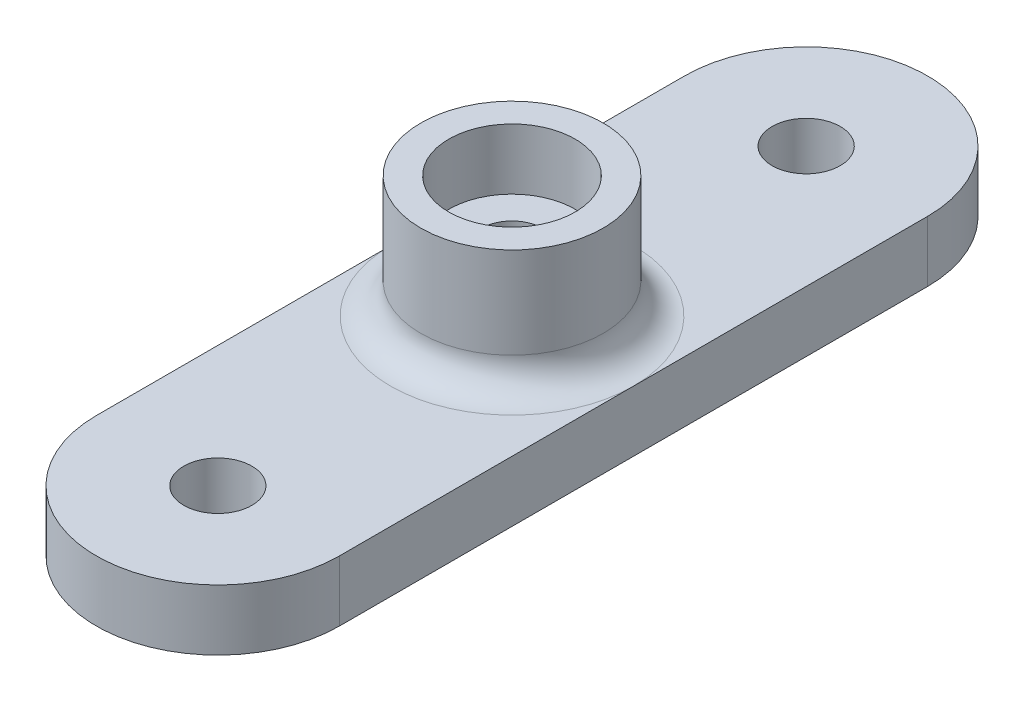
ISO-10303-21;
HEADER;
FILE_DESCRIPTION(('STEP AP214'),'2;1');
FILE_NAME('part.step','',(''),(''),'','','');
FILE_SCHEMA(('AUTOMOTIVE_DESIGN { 1 0 10303 214 1 1 1 1 }'));
ENDSEC;
DATA;
#1=APPLICATION_CONTEXT('core data for automotive mechanical design processes');
#2=APPLICATION_PROTOCOL_DEFINITION('international standard','automotive_design',2000,#1);
#3=PRODUCT_CONTEXT('',#1,'mechanical');
#4=PRODUCT('Part','Part','',(#3));
#5=PRODUCT_RELATED_PRODUCT_CATEGORY('part','',(#4));
#6=PRODUCT_DEFINITION_FORMATION('','',#4);
#7=PRODUCT_DEFINITION_CONTEXT('part definition',#1,'design');
#8=PRODUCT_DEFINITION('design','',#6,#7);
#9=PRODUCT_DEFINITION_SHAPE('','',#8);
#10=(LENGTH_UNIT() NAMED_UNIT(*) SI_UNIT(.MILLI.,.METRE.));
#11=(NAMED_UNIT(*) PLANE_ANGLE_UNIT() SI_UNIT($,.RADIAN.));
#12=(NAMED_UNIT(*) SI_UNIT($,.STERADIAN.) SOLID_ANGLE_UNIT());
#13=UNCERTAINTY_MEASURE_WITH_UNIT(LENGTH_MEASURE(1.E-05),#10,'distance_accuracy_value','');
#14=(GEOMETRIC_REPRESENTATION_CONTEXT(3) GLOBAL_UNCERTAINTY_ASSIGNED_CONTEXT((#13)) GLOBAL_UNIT_ASSIGNED_CONTEXT((#10,
#11,#12)) REPRESENTATION_CONTEXT('',''));
#15=CARTESIAN_POINT('',(0.,0.,0.));
#16=DIRECTION('',(0.,0.,1.));
#17=DIRECTION('',(1.,0.,0.));
#18=AXIS2_PLACEMENT_3D('',#15,#16,#17);
#19=CARTESIAN_POINT('',(0.,3.175,-15.367));
#20=DIRECTION('',(0.,1.,0.));
#21=DIRECTION('',(0.,0.,1.));
#22=AXIS2_PLACEMENT_3D('',#19,#20,#21);
#23=PLANE('',#22);
#24=CARTESIAN_POINT('',(0.,3.175,-15.367));
#25=DIRECTION('',(0.,1.,0.));
#26=DIRECTION('',(0.,0.,1.));
#27=AXIS2_PLACEMENT_3D('',#24,#25,#26);
#28=CIRCLE('',#27,1.778);
#29=CARTESIAN_POINT('',(0.,3.175,-13.589));
#30=VERTEX_POINT('',#29);
#31=EDGE_CURVE('E138',#30,#30,#28,.T.);
#32=ORIENTED_EDGE('',*,*,#31,.F.);
#33=EDGE_LOOP('',(#32));
#34=FACE_BOUND('',#33,.T.);
#35=DIRECTION('',(0.,0.,1.));
#36=VECTOR('',#35,1.);
#37=CARTESIAN_POINT('',(-6.35000000000001,3.175,-15.367));
#38=LINE('',#37,#36);
#39=CARTESIAN_POINT('',(-6.35000000000001,3.175,-15.367));
#40=VERTEX_POINT('',#39);
#41=CARTESIAN_POINT('',(-6.35,3.175,0.));
#42=VERTEX_POINT('',#41);
#43=EDGE_CURVE('E79',#40,#42,#38,.T.);
#44=ORIENTED_EDGE('',*,*,#43,.T.);
#45=CARTESIAN_POINT('',(0.,3.175,0.));
#46=DIRECTION('',(0.,1.,0.));
#47=DIRECTION('',(0.,0.,1.));
#48=AXIS2_PLACEMENT_3D('',#45,#46,#47);
#49=CIRCLE('',#48,6.35);
#50=CARTESIAN_POINT('',(6.35,3.175,0.));
#51=VERTEX_POINT('',#50);
#52=EDGE_CURVE('E12',#42,#51,#49,.F.);
#53=ORIENTED_EDGE('',*,*,#52,.T.);
#54=DIRECTION('',(0.,0.,-1.));
#55=VECTOR('',#54,1.);
#56=CARTESIAN_POINT('',(6.34999999999999,3.175,-15.367));
#57=LINE('',#56,#55);
#58=CARTESIAN_POINT('',(6.34999999999999,3.175,-15.367));
#59=VERTEX_POINT('',#58);
#60=EDGE_CURVE('E93',#51,#59,#57,.T.);
#61=ORIENTED_EDGE('',*,*,#60,.T.);
#62=CARTESIAN_POINT('',(0.,3.175,-15.367));
#63=DIRECTION('',(0.,1.,0.));
#64=DIRECTION('',(0.,0.,1.));
#65=AXIS2_PLACEMENT_3D('',#62,#63,#64);
#66=CIRCLE('',#65,6.35);
#67=EDGE_CURVE('E91',#59,#40,#66,.T.);
#68=ORIENTED_EDGE('',*,*,#67,.T.);
#69=EDGE_LOOP('',(#44,#53,#61,#68));
#70=FACE_BOUND('',#69,.T.);
#71=ADVANCED_FACE('F35',(#34,#70),#23,.T.);
#72=CARTESIAN_POINT('',(0.,3.175,0.));
#73=DIRECTION('',(0.,-1.,0.));
#74=DIRECTION('',(0.,0.,-1.));
#75=AXIS2_PLACEMENT_3D('',#72,#73,#74);
#76=CYLINDRICAL_SURFACE('',#75,1.5875);
#77=CARTESIAN_POINT('',(0.,0.,0.));
#78=DIRECTION('',(0.,1.,0.));
#79=DIRECTION('',(0.,0.,1.));
#80=AXIS2_PLACEMENT_3D('',#77,#78,#79);
#81=CIRCLE('',#80,1.5875);
#82=CARTESIAN_POINT('',(0.,0.,1.5875));
#83=VERTEX_POINT('',#82);
#84=EDGE_CURVE('E119',#83,#83,#81,.T.);
#85=ORIENTED_EDGE('',*,*,#84,.F.);
#86=EDGE_LOOP('',(#85));
#87=FACE_BOUND('',#86,.T.);
#88=CARTESIAN_POINT('',(0.,6.35,0.));
#89=DIRECTION('',(0.,1.,0.));
#90=DIRECTION('',(0.,0.,1.));
#91=AXIS2_PLACEMENT_3D('',#88,#89,#90);
#92=CIRCLE('',#91,1.5875);
#93=CARTESIAN_POINT('',(0.,6.35,1.5875));
#94=VERTEX_POINT('',#93);
#95=EDGE_CURVE('E112',#94,#94,#92,.T.);
#96=ORIENTED_EDGE('',*,*,#95,.T.);
#97=EDGE_LOOP('',(#96));
#98=FACE_BOUND('',#97,.T.);
#99=ADVANCED_FACE('F169',(#87,#98),#76,.F.);
#100=CARTESIAN_POINT('',(6.35,3.175,15.367));
#101=VERTEX_POINT('',#100);
#102=EDGE_CURVE('E144',#101,#51,#57,.T.);
#103=ORIENTED_EDGE('',*,*,#102,.T.);
#104=CARTESIAN_POINT('',(0.,3.175,0.));
#105=DIRECTION('',(0.,1.,0.));
#106=DIRECTION('',(0.,0.,1.));
#107=AXIS2_PLACEMENT_3D('',#104,#105,#106);
#108=CIRCLE('',#107,6.35);
#109=EDGE_CURVE('E43',#51,#42,#108,.F.);
#110=ORIENTED_EDGE('',*,*,#109,.T.);
#111=CARTESIAN_POINT('',(-6.34999999999999,3.175,15.367));
#112=VERTEX_POINT('',#111);
#113=EDGE_CURVE('E86',#42,#112,#38,.T.);
#114=ORIENTED_EDGE('',*,*,#113,.T.);
#115=CARTESIAN_POINT('',(0.,3.175,15.367));
#116=DIRECTION('',(0.,1.,0.));
#117=DIRECTION('',(0.,0.,1.));
#118=AXIS2_PLACEMENT_3D('',#115,#116,#117);
#119=CIRCLE('',#118,6.35);
#120=EDGE_CURVE('E88',#112,#101,#119,.T.);
#121=ORIENTED_EDGE('',*,*,#120,.T.);
#122=EDGE_LOOP('',(#103,#110,#114,#121));
#123=FACE_BOUND('',#122,.T.);
#124=CARTESIAN_POINT('',(0.,3.175,15.367));
#125=DIRECTION('',(0.,1.,0.));
#126=DIRECTION('',(0.,0.,1.));
#127=AXIS2_PLACEMENT_3D('',#124,#125,#126);
#128=CIRCLE('',#127,1.778);
#129=CARTESIAN_POINT('',(0.,3.175,17.145));
#130=VERTEX_POINT('',#129);
#131=EDGE_CURVE('E132',#130,#130,#128,.T.);
#132=ORIENTED_EDGE('',*,*,#131,.F.);
#133=EDGE_LOOP('',(#132));
#134=FACE_BOUND('',#133,.T.);
#135=ADVANCED_FACE('F166',(#123,#134),#23,.T.);
#136=CARTESIAN_POINT('',(0.,0.,-15.367));
#137=DIRECTION('',(0.,1.,0.));
#138=DIRECTION('',(0.,0.,1.));
#139=AXIS2_PLACEMENT_3D('',#136,#137,#138);
#140=PLANE('',#139);
#141=CARTESIAN_POINT('',(0.,0.,-15.367));
#142=DIRECTION('',(0.,1.,0.));
#143=DIRECTION('',(0.,0.,1.));
#144=AXIS2_PLACEMENT_3D('',#141,#142,#143);
#145=CIRCLE('',#144,6.35);
#146=CARTESIAN_POINT('',(6.34999999999999,0.,-15.367));
#147=VERTEX_POINT('',#146);
#148=CARTESIAN_POINT('',(-6.35000000000001,0.,-15.367));
#149=VERTEX_POINT('',#148);
#150=EDGE_CURVE('E101',#147,#149,#145,.T.);
#151=ORIENTED_EDGE('',*,*,#150,.F.);
#152=DIRECTION('',(0.,0.,-1.));
#153=VECTOR('',#152,1.);
#154=CARTESIAN_POINT('',(6.34999999999999,0.,-15.367));
#155=LINE('',#154,#153);
#156=CARTESIAN_POINT('',(6.35,0.,15.367));
#157=VERTEX_POINT('',#156);
#158=EDGE_CURVE('E97',#157,#147,#155,.T.);
#159=ORIENTED_EDGE('',*,*,#158,.F.);
#160=CARTESIAN_POINT('',(0.,0.,15.367));
#161=DIRECTION('',(0.,1.,0.));
#162=DIRECTION('',(0.,0.,1.));
#163=AXIS2_PLACEMENT_3D('',#160,#161,#162);
#164=CIRCLE('',#163,6.35);
#165=CARTESIAN_POINT('',(-6.34999999999999,0.,15.367));
#166=VERTEX_POINT('',#165);
#167=EDGE_CURVE('E150',#166,#157,#164,.T.);
#168=ORIENTED_EDGE('',*,*,#167,.F.);
#169=DIRECTION('',(0.,0.,1.));
#170=VECTOR('',#169,1.);
#171=CARTESIAN_POINT('',(-6.35000000000001,0.,-15.367));
#172=LINE('',#171,#170);
#173=EDGE_CURVE('E148',#149,#166,#172,.T.);
#174=ORIENTED_EDGE('',*,*,#173,.F.);
#175=EDGE_LOOP('',(#151,#159,#168,#174));
#176=FACE_BOUND('',#175,.T.);
#177=CARTESIAN_POINT('',(0.,0.,-15.367));
#178=DIRECTION('',(0.,1.,0.));
#179=DIRECTION('',(0.,0.,1.));
#180=AXIS2_PLACEMENT_3D('',#177,#178,#179);
#181=CIRCLE('',#180,1.778);
#182=CARTESIAN_POINT('',(0.,0.,-13.589));
#183=VERTEX_POINT('',#182);
#184=EDGE_CURVE('E135',#183,#183,#181,.T.);
#185=ORIENTED_EDGE('',*,*,#184,.T.);
#186=EDGE_LOOP('',(#185));
#187=FACE_BOUND('',#186,.T.);
#188=CARTESIAN_POINT('',(0.,0.,15.367));
#189=DIRECTION('',(0.,1.,0.));
#190=DIRECTION('',(0.,0.,1.));
#191=AXIS2_PLACEMENT_3D('',#188,#189,#190);
#192=CIRCLE('',#191,1.778);
#193=CARTESIAN_POINT('',(0.,0.,17.145));
#194=VERTEX_POINT('',#193);
#195=EDGE_CURVE('E131',#194,#194,#192,.T.);
#196=ORIENTED_EDGE('',*,*,#195,.T.);
#197=EDGE_LOOP('',(#196));
#198=FACE_BOUND('',#197,.T.);
#199=ORIENTED_EDGE('',*,*,#84,.T.);
#200=EDGE_LOOP('',(#199));
#201=FACE_BOUND('',#200,.T.);
#202=ADVANCED_FACE('F163',(#176,#187,#198,#201),#140,.F.);
#203=CARTESIAN_POINT('',(0.,3.175,-15.367));
#204=DIRECTION('',(0.,-1.,0.));
#205=DIRECTION('',(0.,0.,-1.));
#206=AXIS2_PLACEMENT_3D('',#203,#204,#205);
#207=CYLINDRICAL_SURFACE('',#206,6.35);
#208=ORIENTED_EDGE('',*,*,#150,.T.);
#209=DIRECTION('',(0.,-1.,0.));
#210=VECTOR('',#209,1.);
#211=CARTESIAN_POINT('',(-6.35000000000001,3.175,-15.367));
#212=LINE('',#211,#210);
#213=EDGE_CURVE('E83',#40,#149,#212,.T.);
#214=ORIENTED_EDGE('',*,*,#213,.F.);
#215=ORIENTED_EDGE('',*,*,#67,.F.);
#216=DIRECTION('',(0.,-1.,0.));
#217=VECTOR('',#216,1.);
#218=CARTESIAN_POINT('',(6.34999999999999,3.175,-15.367));
#219=LINE('',#218,#217);
#220=EDGE_CURVE('E146',#59,#147,#219,.T.);
#221=ORIENTED_EDGE('',*,*,#220,.T.);
#222=EDGE_LOOP('',(#208,#214,#215,#221));
#223=FACE_BOUND('',#222,.T.);
#224=ADVANCED_FACE('F99',(#223),#207,.T.);
#225=CARTESIAN_POINT('',(-6.35000000000001,3.175,-15.367));
#226=DIRECTION('',(1.,0.,0.));
#227=DIRECTION('',(0.,0.,-1.));
#228=AXIS2_PLACEMENT_3D('',#225,#226,#227);
#229=PLANE('',#228);
#230=ORIENTED_EDGE('',*,*,#173,.T.);
#231=DIRECTION('',(0.,-1.,0.));
#232=VECTOR('',#231,1.);
#233=CARTESIAN_POINT('',(-6.34999999999999,3.175,15.367));
#234=LINE('',#233,#232);
#235=EDGE_CURVE('E103',#112,#166,#234,.T.);
#236=ORIENTED_EDGE('',*,*,#235,.F.);
#237=ORIENTED_EDGE('',*,*,#113,.F.);
#238=ORIENTED_EDGE('',*,*,#43,.F.);
#239=ORIENTED_EDGE('',*,*,#213,.T.);
#240=EDGE_LOOP('',(#230,#236,#237,#238,#239));
#241=FACE_BOUND('',#240,.T.);
#242=ADVANCED_FACE('F81',(#241),#229,.F.);
#243=CARTESIAN_POINT('',(0.,3.175,15.367));
#244=DIRECTION('',(0.,-1.,0.));
#245=DIRECTION('',(0.,0.,-1.));
#246=AXIS2_PLACEMENT_3D('',#243,#244,#245);
#247=CYLINDRICAL_SURFACE('',#246,6.35);
#248=ORIENTED_EDGE('',*,*,#167,.T.);
#249=DIRECTION('',(0.,-1.,0.));
#250=VECTOR('',#249,1.);
#251=CARTESIAN_POINT('',(6.35,3.175,15.367));
#252=LINE('',#251,#250);
#253=EDGE_CURVE('E108',#101,#157,#252,.T.);
#254=ORIENTED_EDGE('',*,*,#253,.F.);
#255=ORIENTED_EDGE('',*,*,#120,.F.);
#256=ORIENTED_EDGE('',*,*,#235,.T.);
#257=EDGE_LOOP('',(#248,#254,#255,#256));
#258=FACE_BOUND('',#257,.T.);
#259=ADVANCED_FACE('F165',(#258),#247,.T.);
#260=CARTESIAN_POINT('',(6.34999999999999,3.175,-15.367));
#261=DIRECTION('',(-1.,0.,0.));
#262=DIRECTION('',(0.,0.,1.));
#263=AXIS2_PLACEMENT_3D('',#260,#261,#262);
#264=PLANE('',#263);
#265=ORIENTED_EDGE('',*,*,#158,.T.);
#266=ORIENTED_EDGE('',*,*,#220,.F.);
#267=ORIENTED_EDGE('',*,*,#60,.F.);
#268=ORIENTED_EDGE('',*,*,#102,.F.);
#269=ORIENTED_EDGE('',*,*,#253,.T.);
#270=EDGE_LOOP('',(#265,#266,#267,#268,#269));
#271=FACE_BOUND('',#270,.T.);
#272=ADVANCED_FACE('F158',(#271),#264,.F.);
#273=CARTESIAN_POINT('',(0.,3.175,-15.367));
#274=DIRECTION('',(0.,-1.,0.));
#275=DIRECTION('',(0.,0.,-1.));
#276=AXIS2_PLACEMENT_3D('',#273,#274,#275);
#277=CYLINDRICAL_SURFACE('',#276,1.778);
#278=ORIENTED_EDGE('',*,*,#31,.T.);
#279=EDGE_LOOP('',(#278));
#280=FACE_BOUND('',#279,.T.);
#281=ORIENTED_EDGE('',*,*,#184,.F.);
#282=EDGE_LOOP('',(#281));
#283=FACE_BOUND('',#282,.T.);
#284=ADVANCED_FACE('F177',(#280,#283),#277,.F.);
#285=CARTESIAN_POINT('',(0.,3.175,15.367));
#286=DIRECTION('',(0.,-1.,0.));
#287=DIRECTION('',(0.,0.,-1.));
#288=AXIS2_PLACEMENT_3D('',#285,#286,#287);
#289=CYLINDRICAL_SURFACE('',#288,1.778);
#290=ORIENTED_EDGE('',*,*,#131,.T.);
#291=EDGE_LOOP('',(#290));
#292=FACE_BOUND('',#291,.T.);
#293=ORIENTED_EDGE('',*,*,#195,.F.);
#294=EDGE_LOOP('',(#293));
#295=FACE_BOUND('',#294,.T.);
#296=ADVANCED_FACE('F173',(#292,#295),#289,.F.);
#297=CARTESIAN_POINT('',(0.,32.5203841816037,0.));
#298=DIRECTION('',(0.,-1.,0.));
#299=DIRECTION('',(0.,0.,-1.));
#300=AXIS2_PLACEMENT_3D('',#297,#298,#299);
#301=CYLINDRICAL_SURFACE('',#300,4.7625);
#302=CARTESIAN_POINT('',(0.,4.7625,0.));
#303=DIRECTION('',(0.,1.,0.));
#304=DIRECTION('',(0.,0.,1.));
#305=AXIS2_PLACEMENT_3D('',#302,#303,#304);
#306=CIRCLE('',#305,4.7625);
#307=CARTESIAN_POINT('',(0.,4.7625,4.7625));
#308=VERTEX_POINT('',#307);
#309=EDGE_CURVE('E102',#308,#308,#306,.T.);
#310=ORIENTED_EDGE('',*,*,#309,.T.);
#311=EDGE_LOOP('',(#310));
#312=FACE_BOUND('',#311,.T.);
#313=CARTESIAN_POINT('',(0.,9.525,0.));
#314=DIRECTION('',(0.,1.,0.));
#315=DIRECTION('',(0.,0.,1.));
#316=AXIS2_PLACEMENT_3D('',#313,#314,#315);
#317=CIRCLE('',#316,4.7625);
#318=CARTESIAN_POINT('',(0.,9.525,4.7625));
#319=VERTEX_POINT('',#318);
#320=EDGE_CURVE('E114',#319,#319,#317,.T.);
#321=ORIENTED_EDGE('',*,*,#320,.F.);
#322=EDGE_LOOP('',(#321));
#323=FACE_BOUND('',#322,.T.);
#324=ADVANCED_FACE('F176',(#312,#323),#301,.T.);
#325=CARTESIAN_POINT('',(0.,9.525,-15.367));
#326=DIRECTION('',(0.,1.,0.));
#327=DIRECTION('',(0.,0.,1.));
#328=AXIS2_PLACEMENT_3D('',#325,#326,#327);
#329=PLANE('',#328);
#330=CARTESIAN_POINT('',(0.,9.525,0.));
#331=DIRECTION('',(0.,1.,0.));
#332=DIRECTION('',(0.,0.,1.));
#333=AXIS2_PLACEMENT_3D('',#330,#331,#332);
#334=CIRCLE('',#333,3.302);
#335=CARTESIAN_POINT('',(0.,9.525,3.302));
#336=VERTEX_POINT('',#335);
#337=EDGE_CURVE('E122',#336,#336,#334,.T.);
#338=ORIENTED_EDGE('',*,*,#337,.F.);
#339=EDGE_LOOP('',(#338));
#340=FACE_BOUND('',#339,.T.);
#341=ORIENTED_EDGE('',*,*,#320,.T.);
#342=EDGE_LOOP('',(#341));
#343=FACE_BOUND('',#342,.T.);
#344=ADVANCED_FACE('F235',(#340,#343),#329,.T.);
#345=CARTESIAN_POINT('',(0.,6.35,0.));
#346=DIRECTION('',(0.,1.,0.));
#347=DIRECTION('',(0.,0.,1.));
#348=AXIS2_PLACEMENT_3D('',#345,#346,#347);
#349=CYLINDRICAL_SURFACE('',#348,3.302);
#350=CARTESIAN_POINT('',(0.,6.35,0.));
#351=DIRECTION('',(0.,1.,0.));
#352=DIRECTION('',(0.,0.,1.));
#353=AXIS2_PLACEMENT_3D('',#350,#351,#352);
#354=CIRCLE('',#353,3.302);
#355=CARTESIAN_POINT('',(0.,6.35,3.302));
#356=VERTEX_POINT('',#355);
#357=EDGE_CURVE('E115',#356,#356,#354,.T.);
#358=ORIENTED_EDGE('',*,*,#357,.F.);
#359=EDGE_LOOP('',(#358));
#360=FACE_BOUND('',#359,.T.);
#361=ORIENTED_EDGE('',*,*,#337,.T.);
#362=EDGE_LOOP('',(#361));
#363=FACE_BOUND('',#362,.T.);
#364=ADVANCED_FACE('F243',(#360,#363),#349,.F.);
#365=CARTESIAN_POINT('',(0.,6.35,0.));
#366=DIRECTION('',(0.,1.,0.));
#367=DIRECTION('',(0.,0.,1.));
#368=AXIS2_PLACEMENT_3D('',#365,#366,#367);
#369=PLANE('',#368);
#370=ORIENTED_EDGE('',*,*,#95,.F.);
#371=EDGE_LOOP('',(#370));
#372=FACE_BOUND('',#371,.T.);
#373=ORIENTED_EDGE('',*,*,#357,.T.);
#374=EDGE_LOOP('',(#373));
#375=FACE_BOUND('',#374,.T.);
#376=ADVANCED_FACE('F250',(#372,#375),#369,.T.);
#377=CARTESIAN_POINT('',(0.,4.7625,0.));
#378=DIRECTION('',(0.,1.,0.));
#379=DIRECTION('',(0.,0.,1.));
#380=AXIS2_PLACEMENT_3D('',#377,#378,#379);
#381=TOROIDAL_SURFACE('',#380,6.35,1.5875);
#382=ORIENTED_EDGE('',*,*,#109,.F.);
#383=ORIENTED_EDGE('',*,*,#52,.F.);
#384=EDGE_LOOP('',(#382,#383));
#385=FACE_BOUND('',#384,.T.);
#386=ORIENTED_EDGE('',*,*,#309,.F.);
#387=EDGE_LOOP('',(#386));
#388=FACE_BOUND('',#387,.T.);
#389=ADVANCED_FACE('F37',(#385,#388),#381,.F.);
#390=CLOSED_SHELL('',(#71,#99,#135,#202,#224,#242,#259,#272,#284,#296,#324,#344,#364,#376,#389));
#391=MANIFOLD_SOLID_BREP('B2',#390);
#392=ADVANCED_BREP_SHAPE_REPRESENTATION('',(#18,#391),#14);
#393=SHAPE_DEFINITION_REPRESENTATION(#9,#392);
ENDSEC;
END-ISO-10303-21;
